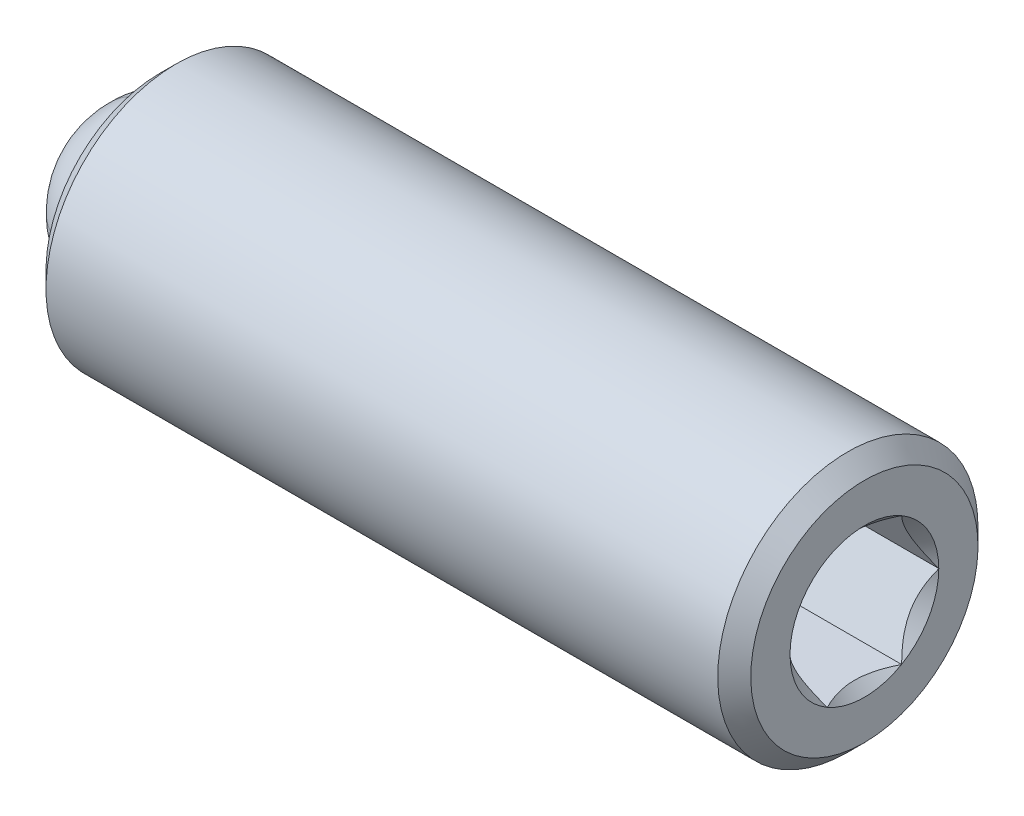
ISO-10303-21;
HEADER;
FILE_DESCRIPTION(('STEP AP214'),'2;1');
FILE_NAME('part.step','',(''),(''),'','','');
FILE_SCHEMA(('AUTOMOTIVE_DESIGN { 1 0 10303 214 1 1 1 1 }'));
ENDSEC;
DATA;
#1=APPLICATION_CONTEXT('core data for automotive mechanical design processes');
#2=APPLICATION_PROTOCOL_DEFINITION('international standard','automotive_design',2000,#1);
#3=PRODUCT_CONTEXT('',#1,'mechanical');
#4=PRODUCT('Part','Part','',(#3));
#5=PRODUCT_RELATED_PRODUCT_CATEGORY('part','',(#4));
#6=PRODUCT_DEFINITION_FORMATION('','',#4);
#7=PRODUCT_DEFINITION_CONTEXT('part definition',#1,'design');
#8=PRODUCT_DEFINITION('design','',#6,#7);
#9=PRODUCT_DEFINITION_SHAPE('','',#8);
#10=(LENGTH_UNIT() NAMED_UNIT(*) SI_UNIT(.MILLI.,.METRE.));
#11=(NAMED_UNIT(*) PLANE_ANGLE_UNIT() SI_UNIT($,.RADIAN.));
#12=(NAMED_UNIT(*) SI_UNIT($,.STERADIAN.) SOLID_ANGLE_UNIT());
#13=UNCERTAINTY_MEASURE_WITH_UNIT(LENGTH_MEASURE(1.E-05),#10,'distance_accuracy_value','');
#14=(GEOMETRIC_REPRESENTATION_CONTEXT(3) GLOBAL_UNCERTAINTY_ASSIGNED_CONTEXT((#13)) GLOBAL_UNIT_ASSIGNED_CONTEXT((#10,
#11,#12)) REPRESENTATION_CONTEXT('',''));
#15=CARTESIAN_POINT('',(0.,0.,0.));
#16=DIRECTION('',(0.,0.,1.));
#17=DIRECTION('',(1.,0.,0.));
#18=AXIS2_PLACEMENT_3D('',#15,#16,#17);
#19=CARTESIAN_POINT('',(0.180392968043054,9.47169867271214,-5.31063574101154));
#20=DIRECTION('',(1.,0.,0.));
#21=DIRECTION('',(0.,0.,-1.));
#22=AXIS2_PLACEMENT_3D('',#19,#20,#21);
#23=PLANE('',#22);
#24=CARTESIAN_POINT('',(0.180392968043055,9.47169867271214,-5.31063574101154));
#25=DIRECTION('',(1.,0.,0.));
#26=DIRECTION('',(0.,0.,-1.));
#27=AXIS2_PLACEMENT_3D('',#24,#25,#26);
#28=CIRCLE('',#27,0.99694999999999);
#29=CARTESIAN_POINT('',(0.180392968043055,10.0642905370944,-6.11234902190932));
#30=VERTEX_POINT('',#29);
#31=CARTESIAN_POINT('',(0.180392968043055,10.4622986727121,-5.4229787091937));
#32=VERTEX_POINT('',#31);
#33=EDGE_CURVE('P0_E11',#30,#32,#28,.T.);
#34=ORIENTED_EDGE('',*,*,#33,.F.);
#35=DIRECTION('',(0.,0.866025403784439,0.5));
#36=VECTOR('',#35,1.);
#37=CARTESIAN_POINT('',(0.180392968043054,9.47169867271214,-6.45448209433002));
#38=LINE('',#37,#36);
#39=CARTESIAN_POINT('',(0.180392968043054,10.4622986727121,-5.88255891767078));
#40=VERTEX_POINT('',#39);
#41=EDGE_CURVE('P0_E247',#30,#40,#38,.T.);
#42=ORIENTED_EDGE('',*,*,#41,.T.);
#43=DIRECTION('',(0.,0.,1.));
#44=VECTOR('',#43,1.);
#45=CARTESIAN_POINT('',(0.180392968043054,10.4622986727121,-5.88255891767078));
#46=LINE('',#45,#44);
#47=EDGE_CURVE('P0_E254',#40,#32,#46,.T.);
#48=ORIENTED_EDGE('',*,*,#47,.T.);
#49=EDGE_LOOP('',(#34,#42,#48));
#50=FACE_BOUND('',#49,.T.);
#51=ADVANCED_FACE('P0_F17',(#50),#23,.T.);
#52=CARTESIAN_POINT('',(0.180392968043055,10.4622986727121,-5.19829277282938));
#53=VERTEX_POINT('',#52);
#54=CARTESIAN_POINT('',(0.180392968043055,10.0642905370944,-4.50892246011375));
#55=VERTEX_POINT('',#54);
#56=EDGE_CURVE('P0_E32',#53,#55,#28,.T.);
#57=ORIENTED_EDGE('',*,*,#56,.F.);
#58=CARTESIAN_POINT('',(0.180392968043054,10.4622986727121,-4.7387125643523));
#59=VERTEX_POINT('',#58);
#60=EDGE_CURVE('P0_E252',#53,#59,#46,.T.);
#61=ORIENTED_EDGE('',*,*,#60,.T.);
#62=DIRECTION('',(0.,-0.866025403784439,0.5));
#63=VECTOR('',#62,1.);
#64=CARTESIAN_POINT('',(0.180392968043054,10.4622986727121,-4.7387125643523));
#65=LINE('',#64,#63);
#66=EDGE_CURVE('P0_E228',#59,#55,#65,.T.);
#67=ORIENTED_EDGE('',*,*,#66,.T.);
#68=EDGE_LOOP('',(#57,#61,#67));
#69=FACE_BOUND('',#68,.T.);
#70=ADVANCED_FACE('P0_F346',(#69),#23,.T.);
#71=CARTESIAN_POINT('',(0.180392968043055,9.86970680832984,-4.39657949193159));
#72=VERTEX_POINT('',#71);
#73=CARTESIAN_POINT('',(0.180392968043055,9.07369053709444,-4.39657949193159));
#74=VERTEX_POINT('',#73);
#75=EDGE_CURVE('P0_E327',#72,#74,#28,.T.);
#76=ORIENTED_EDGE('',*,*,#75,.F.);
#77=CARTESIAN_POINT('',(0.180392968043054,9.47169867271214,-4.16678938769305));
#78=VERTEX_POINT('',#77);
#79=EDGE_CURVE('P0_E233',#72,#78,#65,.T.);
#80=ORIENTED_EDGE('',*,*,#79,.T.);
#81=DIRECTION('',(0.,-0.866025403784439,-0.5));
#82=VECTOR('',#81,1.);
#83=CARTESIAN_POINT('',(0.180392968043054,9.47169867271214,-4.16678938769305));
#84=LINE('',#83,#82);
#85=EDGE_CURVE('P0_E234',#78,#74,#84,.T.);
#86=ORIENTED_EDGE('',*,*,#85,.T.);
#87=EDGE_LOOP('',(#76,#80,#86));
#88=FACE_BOUND('',#87,.T.);
#89=ADVANCED_FACE('P0_F393',(#88),#23,.T.);
#90=CARTESIAN_POINT('',(0.180392968043055,8.87910680832983,-4.50892246011376));
#91=VERTEX_POINT('',#90);
#92=CARTESIAN_POINT('',(0.180392968043055,8.48109867271214,-5.19829277282937));
#93=VERTEX_POINT('',#92);
#94=EDGE_CURVE('P0_E322',#91,#93,#28,.T.);
#95=ORIENTED_EDGE('',*,*,#94,.F.);
#96=CARTESIAN_POINT('',(0.180392968043054,8.48109867271214,-4.73871256435229));
#97=VERTEX_POINT('',#96);
#98=EDGE_CURVE('P0_E231',#91,#97,#84,.T.);
#99=ORIENTED_EDGE('',*,*,#98,.T.);
#100=DIRECTION('',(0.,0.,-1.));
#101=VECTOR('',#100,1.);
#102=CARTESIAN_POINT('',(0.180392968043054,8.48109867271214,-4.73871256435229));
#103=LINE('',#102,#101);
#104=EDGE_CURVE('P0_E239',#97,#93,#103,.T.);
#105=ORIENTED_EDGE('',*,*,#104,.T.);
#106=EDGE_LOOP('',(#95,#99,#105));
#107=FACE_BOUND('',#106,.T.);
#108=ADVANCED_FACE('P0_F404',(#107),#23,.T.);
#109=CARTESIAN_POINT('',(0.180392968043055,8.48109867271214,-5.42297870919371));
#110=VERTEX_POINT('',#109);
#111=CARTESIAN_POINT('',(0.180392968043055,8.87910680832983,-6.11234902190932));
#112=VERTEX_POINT('',#111);
#113=EDGE_CURVE('P0_E319',#110,#112,#28,.T.);
#114=ORIENTED_EDGE('',*,*,#113,.F.);
#115=CARTESIAN_POINT('',(0.180392968043054,8.48109867271214,-5.88255891767078));
#116=VERTEX_POINT('',#115);
#117=EDGE_CURVE('P0_E237',#110,#116,#103,.T.);
#118=ORIENTED_EDGE('',*,*,#117,.T.);
#119=DIRECTION('',(0.,0.866025403784439,-0.5));
#120=VECTOR('',#119,1.);
#121=CARTESIAN_POINT('',(0.180392968043054,8.48109867271214,-5.88255891767078));
#122=LINE('',#121,#120);
#123=EDGE_CURVE('P0_E244',#116,#112,#122,.T.);
#124=ORIENTED_EDGE('',*,*,#123,.T.);
#125=EDGE_LOOP('',(#114,#118,#124));
#126=FACE_BOUND('',#125,.T.);
#127=ADVANCED_FACE('P0_F397',(#126),#23,.T.);
#128=CARTESIAN_POINT('',(-7.60320703195695,10.8686986727121,-5.31063574101154));
#129=DIRECTION('',(1.,0.,0.));
#130=DIRECTION('',(0.,1.,0.));
#131=AXIS2_PLACEMENT_3D('',#128,#129,#130);
#132=PLANE('',#131);
#133=CARTESIAN_POINT('',(-7.60320703195695,9.47169867271214,-5.31063574101154));
#134=DIRECTION('',(1.,0.,0.));
#135=DIRECTION('',(0.,1.,0.));
#136=AXIS2_PLACEMENT_3D('',#133,#134,#135);
#137=CIRCLE('',#136,1.746);
#138=CARTESIAN_POINT('',(-7.60320703195695,11.2176986727121,-5.31063574101154));
#139=VERTEX_POINT('',#138);
#140=EDGE_CURVE('P0_E313',#139,#139,#137,.F.);
#141=ORIENTED_EDGE('',*,*,#140,.T.);
#142=EDGE_LOOP('',(#141));
#143=FACE_BOUND('',#142,.T.);
#144=CARTESIAN_POINT('',(-7.60320703195695,9.47169867271214,-5.31063574101154));
#145=DIRECTION('',(-1.,0.,0.));
#146=DIRECTION('',(0.,-1.,0.));
#147=AXIS2_PLACEMENT_3D('',#144,#145,#146);
#148=CIRCLE('',#147,1.397);
#149=CARTESIAN_POINT('',(-7.60320703195695,8.07469867271214,-5.31063574101154));
#150=VERTEX_POINT('',#149);
#151=EDGE_CURVE('P0_E302',#150,#150,#148,.T.);
#152=ORIENTED_EDGE('',*,*,#151,.F.);
#153=EDGE_LOOP('',(#152));
#154=FACE_BOUND('',#153,.T.);
#155=ADVANCED_FACE('P0_F403',(#143,#154),#132,.F.);
#156=CARTESIAN_POINT('',(-5.41811350547307,9.47169867271214,-5.31063574101154));
#157=DIRECTION('',(-1.,0.,0.));
#158=DIRECTION('',(0.,-1.,0.));
#159=AXIS2_PLACEMENT_3D('',#156,#157,#158);
#160=CYLINDRICAL_SURFACE('',#159,1.397);
#161=CARTESIAN_POINT('',(-6.81511350547307,9.47169867271214,-5.31063574101154));
#162=DIRECTION('',(-1.,0.,0.));
#163=DIRECTION('',(0.,-1.,0.));
#164=AXIS2_PLACEMENT_3D('',#161,#162,#163);
#165=CIRCLE('',#164,1.397);
#166=CARTESIAN_POINT('',(-6.81511350547307,8.07469867271214,-5.31063574101154));
#167=VERTEX_POINT('',#166);
#168=EDGE_CURVE('P0_E285',#167,#167,#165,.T.);
#169=ORIENTED_EDGE('',*,*,#168,.F.);
#170=EDGE_LOOP('',(#169));
#171=FACE_BOUND('',#170,.T.);
#172=ORIENTED_EDGE('',*,*,#151,.T.);
#173=EDGE_LOOP('',(#172));
#174=FACE_BOUND('',#173,.T.);
#175=ADVANCED_FACE('P0_F410',(#171,#174),#160,.F.);
#176=CARTESIAN_POINT('',(-6.81511350547307,9.47169867271214,-5.31063574101154));
#177=DIRECTION('',(-1.,0.,0.));
#178=DIRECTION('',(0.,-1.,0.));
#179=AXIS2_PLACEMENT_3D('',#176,#177,#178);
#180=CONICAL_SURFACE('',#179,1.397,0.78539816339745);
#181=CARTESIAN_POINT('',(-5.41811350547307,9.47169867271214,-5.31063574101154));
#182=VERTEX_POINT('',#181);
#183=VERTEX_LOOP('',#182);
#184=FACE_BOUND('',#183,.T.);
#185=ORIENTED_EDGE('',*,*,#168,.T.);
#186=EDGE_LOOP('',(#185));
#187=FACE_BOUND('',#186,.T.);
#188=ADVANCED_FACE('P0_F601',(#184,#187),#180,.F.);
#189=CARTESIAN_POINT('',(3.22839296804305,9.47169867271214,-5.31063574101154));
#190=DIRECTION('',(-1.,0.,0.));
#191=DIRECTION('',(0.,-1.,0.));
#192=AXIS2_PLACEMENT_3D('',#189,#190,#191);
#193=PLANE('',#192);
#194=DIRECTION('',(0.,-0.866025403784439,-0.5));
#195=VECTOR('',#194,1.);
#196=CARTESIAN_POINT('',(3.22839296804305,9.47169867271214,-4.16678938769305));
#197=LINE('',#196,#195);
#198=CARTESIAN_POINT('',(3.22839296804305,8.48256623149346,-4.73786526889485));
#199=VERTEX_POINT('',#198);
#200=CARTESIAN_POINT('',(3.22839296804305,8.48109867271214,-4.73871256435229));
#201=VERTEX_POINT('',#200);
#202=EDGE_CURVE('P0_E262',#199,#201,#197,.T.);
#203=ORIENTED_EDGE('',*,*,#202,.F.);
#204=CARTESIAN_POINT('',(3.22839296804305,9.47169867271214,-5.31063574101154));
#205=DIRECTION('',(1.,0.,0.));
#206=DIRECTION('',(0.,1.,0.));
#207=AXIS2_PLACEMENT_3D('',#204,#205,#206);
#208=CIRCLE('',#207,1.143);
#209=CARTESIAN_POINT('',(3.22839296804305,9.47023111393082,-4.1676366831505));
#210=VERTEX_POINT('',#209);
#211=EDGE_CURVE('P0_E359',#210,#199,#208,.T.);
#212=ORIENTED_EDGE('',*,*,#211,.F.);
#213=CARTESIAN_POINT('',(3.22839296804305,9.47169867271214,-4.16678938769305));
#214=VERTEX_POINT('',#213);
#215=EDGE_CURVE('P0_E263',#214,#210,#197,.T.);
#216=ORIENTED_EDGE('',*,*,#215,.F.);
#217=DIRECTION('',(0.,-0.866025403784439,0.5));
#218=VECTOR('',#217,1.);
#219=CARTESIAN_POINT('',(3.22839296804305,10.4622986727121,-4.7387125643523));
#220=LINE('',#219,#218);
#221=CARTESIAN_POINT('',(3.22839296804305,9.47316459966091,-4.16763574101154));
#222=VERTEX_POINT('',#221);
#223=EDGE_CURVE('P0_E221',#222,#214,#220,.T.);
#224=ORIENTED_EDGE('',*,*,#223,.F.);
#225=CARTESIAN_POINT('',(3.22839296804305,10.4608311139308,-4.73786526889485));
#226=VERTEX_POINT('',#225);
#227=EDGE_CURVE('P0_E48',#226,#222,#208,.T.);
#228=ORIENTED_EDGE('',*,*,#227,.F.);
#229=CARTESIAN_POINT('',(3.22839296804305,10.4622986727121,-4.7387125643523));
#230=VERTEX_POINT('',#229);
#231=EDGE_CURVE('P0_E259',#230,#226,#220,.T.);
#232=ORIENTED_EDGE('',*,*,#231,.F.);
#233=DIRECTION('',(0.,0.,1.));
#234=VECTOR('',#233,1.);
#235=CARTESIAN_POINT('',(3.22839296804305,10.4622986727121,-5.88255891767078));
#236=LINE('',#235,#234);
#237=CARTESIAN_POINT('',(3.22839296804305,10.4622986727121,-4.74040715526719));
#238=VERTEX_POINT('',#237);
#239=EDGE_CURVE('P0_E278',#238,#230,#236,.T.);
#240=ORIENTED_EDGE('',*,*,#239,.F.);
#241=CARTESIAN_POINT('',(3.22839296804305,10.4622986727121,-5.88086432675589));
#242=VERTEX_POINT('',#241);
#243=EDGE_CURVE('P0_E165',#242,#238,#208,.T.);
#244=ORIENTED_EDGE('',*,*,#243,.F.);
#245=CARTESIAN_POINT('',(3.22839296804305,10.4622986727121,-5.88255891767078));
#246=VERTEX_POINT('',#245);
#247=EDGE_CURVE('P0_E279',#246,#242,#236,.T.);
#248=ORIENTED_EDGE('',*,*,#247,.F.);
#249=DIRECTION('',(0.,0.866025403784439,0.5));
#250=VECTOR('',#249,1.);
#251=CARTESIAN_POINT('',(3.22839296804305,9.47169867271214,-6.45448209433002));
#252=LINE('',#251,#250);
#253=CARTESIAN_POINT('',(3.22839296804305,10.4608311139308,-5.88340621312823));
#254=VERTEX_POINT('',#253);
#255=EDGE_CURVE('P0_E274',#254,#246,#252,.T.);
#256=ORIENTED_EDGE('',*,*,#255,.F.);
#257=CARTESIAN_POINT('',(3.22839296804305,9.47316623149346,-6.45363479887258));
#258=VERTEX_POINT('',#257);
#259=EDGE_CURVE('P0_E168',#258,#254,#208,.T.);
#260=ORIENTED_EDGE('',*,*,#259,.F.);
#261=CARTESIAN_POINT('',(3.22839296804305,9.47169867271214,-6.45448209433002));
#262=VERTEX_POINT('',#261);
#263=EDGE_CURVE('P0_E275',#262,#258,#252,.T.);
#264=ORIENTED_EDGE('',*,*,#263,.F.);
#265=DIRECTION('',(0.,0.866025403784439,-0.5));
#266=VECTOR('',#265,1.);
#267=CARTESIAN_POINT('',(3.22839296804305,8.48109867271214,-5.88255891767078));
#268=LINE('',#267,#266);
#269=CARTESIAN_POINT('',(3.22839296804305,9.47023274576337,-6.45363574101154));
#270=VERTEX_POINT('',#269);
#271=EDGE_CURVE('P0_E270',#270,#262,#268,.T.);
#272=ORIENTED_EDGE('',*,*,#271,.F.);
#273=CARTESIAN_POINT('',(3.22839296804305,8.48256623149346,-5.88340621312823));
#274=VERTEX_POINT('',#273);
#275=EDGE_CURVE('P0_E363',#274,#270,#208,.T.);
#276=ORIENTED_EDGE('',*,*,#275,.F.);
#277=CARTESIAN_POINT('',(3.22839296804305,8.48109867271214,-5.88255891767078));
#278=VERTEX_POINT('',#277);
#279=EDGE_CURVE('P0_E271',#278,#274,#268,.T.);
#280=ORIENTED_EDGE('',*,*,#279,.F.);
#281=DIRECTION('',(0.,0.,-1.));
#282=VECTOR('',#281,1.);
#283=CARTESIAN_POINT('',(3.22839296804305,8.48109867271214,-4.73871256435229));
#284=LINE('',#283,#282);
#285=CARTESIAN_POINT('',(3.22839296804305,8.48109867271214,-5.88086432675589));
#286=VERTEX_POINT('',#285);
#287=EDGE_CURVE('P0_E266',#286,#278,#284,.T.);
#288=ORIENTED_EDGE('',*,*,#287,.F.);
#289=CARTESIAN_POINT('',(3.22839296804305,8.48109867271214,-4.74040715526719));
#290=VERTEX_POINT('',#289);
#291=EDGE_CURVE('P0_E360',#290,#286,#208,.T.);
#292=ORIENTED_EDGE('',*,*,#291,.F.);
#293=EDGE_CURVE('P0_E267',#201,#290,#284,.T.);
#294=ORIENTED_EDGE('',*,*,#293,.F.);
#295=EDGE_LOOP('',(#203,#212,#216,#224,#228,#232,#240,#244,#248,#256,#260,#264,#272,#276,#280,
#288,#292,#294));
#296=FACE_BOUND('',#295,.T.);
#297=CARTESIAN_POINT('',(3.22839296804305,9.47169867271214,-5.31063574101154));
#298=DIRECTION('',(-1.,0.,0.));
#299=DIRECTION('',(0.,-1.,0.));
#300=AXIS2_PLACEMENT_3D('',#297,#298,#299);
#301=CIRCLE('',#300,1.746);
#302=CARTESIAN_POINT('',(3.22839296804305,7.72569867271214,-5.31063574101154));
#303=VERTEX_POINT('',#302);
#304=EDGE_CURVE('P0_E311',#303,#303,#301,.F.);
#305=ORIENTED_EDGE('',*,*,#304,.T.);
#306=EDGE_LOOP('',(#305));
#307=FACE_BOUND('',#306,.T.);
#308=ADVANCED_FACE('P0_F354',(#296,#307),#193,.F.);
#309=CARTESIAN_POINT('',(-5.41811350547307,9.47169867271214,-5.31063574101154));
#310=DIRECTION('',(-1.,0.,0.));
#311=DIRECTION('',(0.,-1.,0.));
#312=AXIS2_PLACEMENT_3D('',#309,#310,#311);
#313=CYLINDRICAL_SURFACE('',#312,2.);
#314=CARTESIAN_POINT('',(2.97439296804305,9.47169867271214,-5.31063574101154));
#315=DIRECTION('',(-1.,0.,0.));
#316=DIRECTION('',(0.,-1.,0.));
#317=AXIS2_PLACEMENT_3D('',#314,#315,#316);
#318=CIRCLE('',#317,2.);
#319=CARTESIAN_POINT('',(2.97439296804305,7.47169867271214,-5.31063574101154));
#320=VERTEX_POINT('',#319);
#321=EDGE_CURVE('P0_E308',#320,#320,#318,.T.);
#322=ORIENTED_EDGE('',*,*,#321,.T.);
#323=EDGE_LOOP('',(#322));
#324=FACE_BOUND('',#323,.T.);
#325=CARTESIAN_POINT('',(-7.34920703195695,9.47169867271214,-5.31063574101154));
#326=DIRECTION('',(1.,0.,0.));
#327=DIRECTION('',(0.,1.,0.));
#328=AXIS2_PLACEMENT_3D('',#325,#326,#327);
#329=CIRCLE('',#328,2.);
#330=CARTESIAN_POINT('',(-7.34920703195695,11.4716986727121,-5.31063574101154));
#331=VERTEX_POINT('',#330);
#332=EDGE_CURVE('P0_E305',#331,#331,#329,.T.);
#333=ORIENTED_EDGE('',*,*,#332,.T.);
#334=EDGE_LOOP('',(#333));
#335=FACE_BOUND('',#334,.T.);
#336=ADVANCED_FACE('P0_F211',(#324,#335),#313,.T.);
#337=CARTESIAN_POINT('',(2.97439296804305,9.47169867271214,-5.31063574101154));
#338=DIRECTION('',(-1.,0.,0.));
#339=DIRECTION('',(0.,-1.,0.));
#340=AXIS2_PLACEMENT_3D('',#337,#338,#339);
#341=CONICAL_SURFACE('',#340,2.,0.78539816339745);
#342=ORIENTED_EDGE('',*,*,#304,.F.);
#343=EDGE_LOOP('',(#342));
#344=FACE_BOUND('',#343,.T.);
#345=ORIENTED_EDGE('',*,*,#321,.F.);
#346=EDGE_LOOP('',(#345));
#347=FACE_BOUND('',#346,.T.);
#348=ADVANCED_FACE('P0_F574',(#344,#347),#341,.T.);
#349=CARTESIAN_POINT('',(-7.60320703195695,9.47169867271214,-5.31063574101154));
#350=DIRECTION('',(1.,0.,0.));
#351=DIRECTION('',(0.,1.,0.));
#352=AXIS2_PLACEMENT_3D('',#349,#350,#351);
#353=CONICAL_SURFACE('',#352,1.746,0.785398163397447);
#354=ORIENTED_EDGE('',*,*,#332,.F.);
#355=EDGE_LOOP('',(#354));
#356=FACE_BOUND('',#355,.T.);
#357=ORIENTED_EDGE('',*,*,#140,.F.);
#358=EDGE_LOOP('',(#357));
#359=FACE_BOUND('',#358,.T.);
#360=ADVANCED_FACE('P0_F19',(#356,#359),#353,.T.);
#361=CARTESIAN_POINT('',(0.180392968043054,10.4622986727121,-4.7387125643523));
#362=DIRECTION('',(0.,0.5,0.866025403784439));
#363=DIRECTION('',(0.,-0.866025403784439,0.5));
#364=AXIS2_PLACEMENT_3D('',#361,#362,#363);
#365=PLANE('',#364);
#366=ORIENTED_EDGE('',*,*,#231,.T.);
#367=CARTESIAN_POINT('',(3.22859296804327,10.4611782048666,-4.73806566194003));
#368=CARTESIAN_POINT('',(3.20902650942257,10.4271981526644,-4.71844726965406));
#369=CARTESIAN_POINT('',(3.19061235414986,10.39265070629,-4.69850129218998));
#370=CARTESIAN_POINT('',(3.15690224896556,10.3222088641086,-4.65783167564432));
#371=CARTESIAN_POINT('',(3.14162495574689,10.2863078319104,-4.63710420504048));
#372=CARTESIAN_POINT('',(3.11545811453832,10.2139157570677,-4.5953086211429));
#373=CARTESIAN_POINT('',(3.10450308443333,10.1774429854838,-4.57425105665082));
#374=CARTESIAN_POINT('',(3.08762700747996,10.103698565716,-4.53167469604664));
#375=CARTESIAN_POINT('',(3.08169344522599,10.0664291424649,-4.51015718450008));
#376=CARTESIAN_POINT('',(3.07633957948692,10.0021344350583,-4.47303661787141));
#377=CARTESIAN_POINT('',(3.07555215934539,9.97519176257048,-4.45748125865788));
#378=CARTESIAN_POINT('',(3.07690556505428,9.92135924288741,-4.42640103892771));
#379=CARTESIAN_POINT('',(3.0790470423144,9.89446940877598,-4.41087618596501));
#380=CARTESIAN_POINT('',(3.08972297627782,9.81418524622342,-4.36452410310362));
#381=CARTESIAN_POINT('',(3.10251008931636,9.76119119302302,-4.33392797222292));
#382=CARTESIAN_POINT('',(3.13327126073398,9.66844209710657,-4.28037925672847));
#383=CARTESIAN_POINT('',(3.14959520035295,9.62824129683496,-4.25716931387001));
#384=CARTESIAN_POINT('',(3.18634845720896,9.54940556558132,-4.21165348320896));
#385=CARTESIAN_POINT('',(3.20676437484175,9.51076600589305,-4.18934492302157));
#386=CARTESIAN_POINT('',(3.22859296804305,9.47281914055808,-4.16743629010553));
#387=B_SPLINE_CURVE_WITH_KNOTS('',3,(#367,#368,#369,#370,#371,#372,#373,#374,#375,#376,#377,
#378,#379,#380,#381,#382,#383,#384,#385,#386),.UNSPECIFIED.,.F.,.F.,(4,2,2,2,2,2,2,2,2,4),(0.,
0.131625127619602,0.264011770716204,0.394307736662358,0.524277991049733,0.61750464694129,
0.71075204054236,0.897297861024574,1.04472299547961,1.19167303462289),.UNSPECIFIED.);
#388=EDGE_CURVE('P0_E214',#226,#222,#387,.T.);
#389=ORIENTED_EDGE('',*,*,#388,.T.);
#390=ORIENTED_EDGE('',*,*,#223,.T.);
#391=DIRECTION('',(1.,0.,0.));
#392=VECTOR('',#391,1.);
#393=CARTESIAN_POINT('',(0.180392968043054,9.47169867271214,-4.16678938769305));
#394=LINE('',#393,#392);
#395=EDGE_CURVE('P0_E257',#78,#214,#394,.T.);
#396=ORIENTED_EDGE('',*,*,#395,.F.);
#397=ORIENTED_EDGE('',*,*,#79,.F.);
#398=EDGE_CURVE('P0_E232',#55,#72,#65,.T.);
#399=ORIENTED_EDGE('',*,*,#398,.F.);
#400=ORIENTED_EDGE('',*,*,#66,.F.);
#401=DIRECTION('',(1.,0.,0.));
#402=VECTOR('',#401,1.);
#403=CARTESIAN_POINT('',(0.180392968043054,10.4622986727121,-4.7387125643523));
#404=LINE('',#403,#402);
#405=EDGE_CURVE('P0_E282',#59,#230,#404,.T.);
#406=ORIENTED_EDGE('',*,*,#405,.T.);
#407=EDGE_LOOP('',(#366,#389,#390,#396,#397,#399,#400,#406));
#408=FACE_BOUND('',#407,.T.);
#409=ADVANCED_FACE('P0_F205',(#408),#365,.F.);
#410=CARTESIAN_POINT('',(0.180392968043054,10.4622986727121,-5.88255891767078));
#411=DIRECTION('',(0.,1.,0.));
#412=DIRECTION('',(0.,0.,1.));
#413=AXIS2_PLACEMENT_3D('',#410,#411,#412);
#414=PLANE('',#413);
#415=ORIENTED_EDGE('',*,*,#247,.T.);
#416=CARTESIAN_POINT('',(3.59570318481879,10.4622986727121,-6.45070091059492));
#417=CARTESIAN_POINT('',(3.57474972575544,10.4622986727121,-6.42293842392982));
#418=CARTESIAN_POINT('',(3.55400188885525,10.4622986727121,-6.39502118209199));
#419=CARTESIAN_POINT('',(3.5130023791237,10.4622986727121,-6.33881442617575));
#420=CARTESIAN_POINT('',(3.49275083134308,10.4622986727121,-6.31052482097715));
#421=CARTESIAN_POINT('',(3.4325790283938,10.4622986727121,-6.2245891246577));
#422=CARTESIAN_POINT('',(3.39356434305211,10.4622986727121,-6.16629826503015));
#423=CARTESIAN_POINT('',(3.31697919410661,10.4622986727121,-6.04406836242025));
#424=CARTESIAN_POINT('',(3.27961787130016,10.4622986727121,-5.97999677039252));
#425=CARTESIAN_POINT('',(3.21127977420377,10.4622986727121,-5.84865409060757));
#426=CARTESIAN_POINT('',(3.1802814773501,10.4622986727121,-5.78139476840388));
#427=CARTESIAN_POINT('',(3.14235811095437,10.4622986727121,-5.68043234276318));
#428=CARTESIAN_POINT('',(3.13147285764775,10.4622986727121,-5.64822276177993));
#429=CARTESIAN_POINT('',(3.1122883171656,10.4622986727121,-5.58302650769072));
#430=CARTESIAN_POINT('',(3.10398920830285,10.4622986727121,-5.55003978116972));
#431=CARTESIAN_POINT('',(3.09054716193858,10.4622986727121,-5.48404253052561));
#432=CARTESIAN_POINT('',(3.08534972830344,10.4622986727121,-5.45104328161498));
#433=CARTESIAN_POINT('',(3.07820909094747,10.4622986727121,-5.38468174697183));
#434=CARTESIAN_POINT('',(3.07626638486291,10.4622986727121,-5.35131940650863));
#435=CARTESIAN_POINT('',(3.07578238551576,10.4622986727121,-5.28577621049882));
#436=CARTESIAN_POINT('',(3.07712077837641,10.4622986727121,-5.25359620205024));
#437=CARTESIAN_POINT('',(3.08285889832064,10.4622986727121,-5.18952282412405));
#438=CARTESIAN_POINT('',(3.08725792197463,10.4622986727121,-5.15762939048823));
#439=CARTESIAN_POINT('',(3.098951846285,10.4622986727121,-5.09380411923337));
#440=CARTESIAN_POINT('',(3.10629646335219,10.4622986727121,-5.06188152922137));
#441=CARTESIAN_POINT('',(3.12349136437113,10.4622986727121,-4.99873377437021));
#442=CARTESIAN_POINT('',(3.1333414379426,10.4622986727121,-4.96750855121329));
#443=CARTESIAN_POINT('',(3.16806646410627,10.4622986727121,-4.86917271271039));
#444=CARTESIAN_POINT('',(3.19689729777147,10.4622986727121,-4.80346243249055));
#445=CARTESIAN_POINT('',(3.26099837633354,10.4622986727121,-4.67512903723325));
#446=CARTESIAN_POINT('',(3.29629176147741,10.4622986727121,-4.61251807751064));
#447=CARTESIAN_POINT('',(3.36910429394989,10.4622986727121,-4.49285991026648));
#448=CARTESIAN_POINT('',(3.40642565041756,10.4622986727121,-4.43569083811957));
#449=CARTESIAN_POINT('',(3.46412025413777,10.4622986727121,-4.35146370273486));
#450=CARTESIAN_POINT('',(3.4835551496593,10.4622986727121,-4.32375151954404));
#451=CARTESIAN_POINT('',(3.5229388622672,10.4622986727121,-4.26870581303537));
#452=CARTESIAN_POINT('',(3.5428875373647,10.4622986727121,-4.24137218824255));
#453=CARTESIAN_POINT('',(3.56304924099892,10.4622986727121,-4.21419618453529));
#454=B_SPLINE_CURVE_WITH_KNOTS('',3,(#416,#417,#418,#419,#420,#421,#422,#423,#424,#425,#426,
#427,#428,#429,#430,#431,#432,#433,#434,#435,#436,#437,#438,#439,#440,#441,#442,#443,#444,#445,
#446,#447,#448,#449,#450,#451,#452,#453),.UNSPECIFIED.,.F.,.F.,(4,2,2,2,2,2,2,2,2,2,2,2,2,2,2,2,
2,2,4),(0.,0.104344019556666,0.208714065995309,0.41904723860194,0.64137159542651,
0.862931089855695,0.964842435960927,1.06676080722523,1.16683130424735,1.26691710029625,
1.36338812254199,1.45983698002154,1.55798726512869,1.65612931138883,1.87076833826788,
2.08619150382141,2.29090841446405,2.39244822901591,2.49396027677513),.UNSPECIFIED.);
#455=EDGE_CURVE('P0_E222',#242,#238,#454,.T.);
#456=ORIENTED_EDGE('',*,*,#455,.T.);
#457=ORIENTED_EDGE('',*,*,#239,.T.);
#458=ORIENTED_EDGE('',*,*,#405,.F.);
#459=ORIENTED_EDGE('',*,*,#60,.F.);
#460=EDGE_CURVE('P0_E258',#32,#53,#46,.T.);
#461=ORIENTED_EDGE('',*,*,#460,.F.);
#462=ORIENTED_EDGE('',*,*,#47,.F.);
#463=DIRECTION('',(1.,0.,0.));
#464=VECTOR('',#463,1.);
#465=CARTESIAN_POINT('',(0.180392968043054,10.4622986727121,-5.88255891767078));
#466=LINE('',#465,#464);
#467=EDGE_CURVE('P0_E286',#40,#246,#466,.T.);
#468=ORIENTED_EDGE('',*,*,#467,.T.);
#469=EDGE_LOOP('',(#415,#456,#457,#458,#459,#461,#462,#468));
#470=FACE_BOUND('',#469,.T.);
#471=ADVANCED_FACE('P0_F209',(#470),#414,.F.);
#472=CARTESIAN_POINT('',(0.180392968043054,9.47169867271214,-6.45448209433002));
#473=DIRECTION('',(0.,0.5,-0.866025403784439));
#474=DIRECTION('',(0.,0.866025403784439,0.5));
#475=AXIS2_PLACEMENT_3D('',#472,#473,#474);
#476=PLANE('',#475);
#477=ORIENTED_EDGE('',*,*,#263,.T.);
#478=CARTESIAN_POINT('',(3.22859296804305,9.47281914055808,-6.45383519191755));
#479=CARTESIAN_POINT('',(3.20902650942238,9.50679919276017,-6.43421679963159));
#480=CARTESIAN_POINT('',(3.19061235414969,9.54134663913457,-6.41427082216752));
#481=CARTESIAN_POINT('',(3.15690224896544,9.61178848131595,-6.37360120562189));
#482=CARTESIAN_POINT('',(3.14162495574679,9.64768951351416,-6.35287373501807));
#483=CARTESIAN_POINT('',(3.11545811453826,9.72008158835673,-6.31107815112052));
#484=CARTESIAN_POINT('',(3.10450308443328,9.75655435994065,-6.29002058662845));
#485=CARTESIAN_POINT('',(3.08762700747993,9.83029877970841,-6.2474442260243));
#486=CARTESIAN_POINT('',(3.08169344522598,9.86756820295947,-6.22592671447775));
#487=CARTESIAN_POINT('',(3.07633957948691,9.93186291036605,-6.1888061478491));
#488=CARTESIAN_POINT('',(3.07555215934539,9.95880558285385,-6.17325078863558));
#489=CARTESIAN_POINT('',(3.07690556505429,10.0126381025369,-6.1421705689054));
#490=CARTESIAN_POINT('',(3.0790470423144,10.0395279366484,-6.1266457159427));
#491=CARTESIAN_POINT('',(3.08972297627783,10.1198120992009,-6.08029363308132));
#492=CARTESIAN_POINT('',(3.10251008931638,10.1728061524013,-6.04969750220062));
#493=CARTESIAN_POINT('',(3.13327126073402,10.2655552483178,-5.99614878670614));
#494=CARTESIAN_POINT('',(3.14959520035302,10.3057560485895,-5.97293884384765));
#495=CARTESIAN_POINT('',(3.1863484572091,10.3845917798432,-5.92742301318654));
#496=CARTESIAN_POINT('',(3.20676437484192,10.4232313395315,-5.90511445299912));
#497=CARTESIAN_POINT('',(3.22859296804327,10.4611782048666,-5.88320582008304));
#498=B_SPLINE_CURVE_WITH_KNOTS('',3,(#478,#479,#480,#481,#482,#483,#484,#485,#486,#487,#488,
#489,#490,#491,#492,#493,#494,#495,#496,#497),.UNSPECIFIED.,.F.,.F.,(4,2,2,2,2,2,2,2,2,4),(0.,
0.131625127619502,0.264011770716005,0.39430773666206,0.524277991049337,0.617504646940888,
0.710752040541954,0.897297861024162,1.04472299547941,1.19167303462289),.UNSPECIFIED.);
#499=EDGE_CURVE('P0_E373',#258,#254,#498,.T.);
#500=ORIENTED_EDGE('',*,*,#499,.T.);
#501=ORIENTED_EDGE('',*,*,#255,.T.);
#502=ORIENTED_EDGE('',*,*,#467,.F.);
#503=ORIENTED_EDGE('',*,*,#41,.F.);
#504=CARTESIAN_POINT('',(0.180392968043055,9.86970680832983,-6.22469199009149));
#505=VERTEX_POINT('',#504);
#506=EDGE_CURVE('P0_E253',#505,#30,#38,.T.);
#507=ORIENTED_EDGE('',*,*,#506,.F.);
#508=CARTESIAN_POINT('',(0.180392968043054,9.47169867271214,-6.45448209433002));
#509=VERTEX_POINT('',#508);
#510=EDGE_CURVE('P0_E249',#509,#505,#38,.T.);
#511=ORIENTED_EDGE('',*,*,#510,.F.);
#512=DIRECTION('',(1.,0.,0.));
#513=VECTOR('',#512,1.);
#514=CARTESIAN_POINT('',(0.180392968043054,9.47169867271214,-6.45448209433002));
#515=LINE('',#514,#513);
#516=EDGE_CURVE('P0_E289',#509,#262,#515,.T.);
#517=ORIENTED_EDGE('',*,*,#516,.T.);
#518=EDGE_LOOP('',(#477,#500,#501,#502,#503,#507,#511,#517));
#519=FACE_BOUND('',#518,.T.);
#520=ADVANCED_FACE('P0_F377',(#519),#476,.F.);
#521=CARTESIAN_POINT('',(0.180392968043054,8.48109867271214,-5.88255891767078));
#522=DIRECTION('',(0.,-0.5,-0.866025403784439));
#523=DIRECTION('',(0.,0.866025403784439,-0.5));
#524=AXIS2_PLACEMENT_3D('',#521,#522,#523);
#525=PLANE('',#524);
#526=ORIENTED_EDGE('',*,*,#279,.T.);
#527=CARTESIAN_POINT('',(3.22859296804327,8.48221914055771,-5.88320582008304));
#528=CARTESIAN_POINT('',(3.20902650942257,8.51619919275983,-5.90282421236901));
#529=CARTESIAN_POINT('',(3.19061235414986,8.55074663913425,-5.9227701898331));
#530=CARTESIAN_POINT('',(3.15690224896556,8.62118848131567,-5.96343980637875));
#531=CARTESIAN_POINT('',(3.14162495574689,8.65708951351391,-5.98416727698259));
#532=CARTESIAN_POINT('',(3.11545811453832,8.72948158835652,-6.02596286088017));
#533=CARTESIAN_POINT('',(3.10450308443333,8.76595435994047,-6.04702042537226));
#534=CARTESIAN_POINT('',(3.08762700747995,8.83969877970829,-6.08959678597644));
#535=CARTESIAN_POINT('',(3.08169344522599,8.87696820295938,-6.111114297523));
#536=CARTESIAN_POINT('',(3.07633957948692,8.94126291036599,-6.14823486415167));
#537=CARTESIAN_POINT('',(3.07555215934539,8.96820558285379,-6.16379022336519));
#538=CARTESIAN_POINT('',(3.07690556505428,9.02203810253686,-6.19487044309537));
#539=CARTESIAN_POINT('',(3.0790470423144,9.0489279366483,-6.21039529605807));
#540=CARTESIAN_POINT('',(3.08972297627782,9.12921209920085,-6.25674737891945));
#541=CARTESIAN_POINT('',(3.10251008931636,9.18220615240125,-6.28734350980015));
#542=CARTESIAN_POINT('',(3.13327126073398,9.2749552483177,-6.34089222529461));
#543=CARTESIAN_POINT('',(3.14959520035295,9.31515604858932,-6.36410216815306));
#544=CARTESIAN_POINT('',(3.18634845720896,9.39399177984296,-6.40961799881411));
#545=CARTESIAN_POINT('',(3.20676437484174,9.43263133953122,-6.4319265590015));
#546=CARTESIAN_POINT('',(3.22859296804305,9.47057820486619,-6.45383519191755));
#547=B_SPLINE_CURVE_WITH_KNOTS('',3,(#527,#528,#529,#530,#531,#532,#533,#534,#535,#536,#537,
#538,#539,#540,#541,#542,#543,#544,#545,#546),.UNSPECIFIED.,.F.,.F.,(4,2,2,2,2,2,2,2,2,4),(0.,
0.1316251276196,0.264011770716204,0.394307736662359,0.524277991049733,0.617504646941288,
0.71075204054236,0.897297861024572,1.04472299547962,1.19167303462289),.UNSPECIFIED.);
#548=EDGE_CURVE('P0_E181',#274,#270,#547,.T.);
#549=ORIENTED_EDGE('',*,*,#548,.T.);
#550=ORIENTED_EDGE('',*,*,#271,.T.);
#551=ORIENTED_EDGE('',*,*,#516,.F.);
#552=CARTESIAN_POINT('',(0.180392968043055,9.07369053709444,-6.22469199009149));
#553=VERTEX_POINT('',#552);
#554=EDGE_CURVE('P0_E242',#553,#509,#122,.T.);
#555=ORIENTED_EDGE('',*,*,#554,.F.);
#556=EDGE_CURVE('P0_E248',#112,#553,#122,.T.);
#557=ORIENTED_EDGE('',*,*,#556,.F.);
#558=ORIENTED_EDGE('',*,*,#123,.F.);
#559=DIRECTION('',(1.,0.,0.));
#560=VECTOR('',#559,1.);
#561=CARTESIAN_POINT('',(0.180392968043054,8.48109867271214,-5.88255891767078));
#562=LINE('',#561,#560);
#563=EDGE_CURVE('P0_E292',#116,#278,#562,.T.);
#564=ORIENTED_EDGE('',*,*,#563,.T.);
#565=EDGE_LOOP('',(#526,#549,#550,#551,#555,#557,#558,#564));
#566=FACE_BOUND('',#565,.T.);
#567=ADVANCED_FACE('P0_F196',(#566),#525,.F.);
#568=CARTESIAN_POINT('',(0.180392968043054,8.48109867271214,-4.73871256435229));
#569=DIRECTION('',(0.,-1.,0.));
#570=DIRECTION('',(0.,0.,-1.));
#571=AXIS2_PLACEMENT_3D('',#568,#569,#570);
#572=PLANE('',#571);
#573=ORIENTED_EDGE('',*,*,#293,.T.);
#574=CARTESIAN_POINT('',(3.5957031849486,8.48109867271214,-6.45070091076688));
#575=CARTESIAN_POINT('',(3.57474972588025,8.48109867271214,-6.42293842409696));
#576=CARTESIAN_POINT('',(3.55400188897507,8.48109867271214,-6.39502118225429));
#577=CARTESIAN_POINT('',(3.51300237923356,8.48109867271214,-6.33881442632833));
#578=CARTESIAN_POINT('',(3.49275083144798,8.48109867271214,-6.31052482112484));
#579=CARTESIAN_POINT('',(3.43257902848372,8.48109867271214,-6.22458912479043));
#580=CARTESIAN_POINT('',(3.39356434313208,8.48109867271214,-6.16629826515271));
#581=CARTESIAN_POINT('',(3.31697919416612,8.48109867271214,-6.04406836252062));
#582=CARTESIAN_POINT('',(3.27961787134924,8.48109867271214,-5.97999677048082));
#583=CARTESIAN_POINT('',(3.2112797742335,8.48109867271214,-5.8486540906707));
#584=CARTESIAN_POINT('',(3.18028147737091,8.48109867271214,-5.78139476845393));
#585=CARTESIAN_POINT('',(3.14235811096854,8.48109867271214,-5.68043234280337));
#586=CARTESIAN_POINT('',(3.13147285766218,8.48109867271214,-5.64822276182425));
#587=CARTESIAN_POINT('',(3.11228831717971,8.48109867271214,-5.58302650774342));
#588=CARTESIAN_POINT('',(3.10398920831638,8.48109867271214,-5.55003978122668));
#589=CARTESIAN_POINT('',(3.09054716194998,8.48109867271214,-5.48404253059095));
#590=CARTESIAN_POINT('',(3.08534972831333,8.48109867271214,-5.45104328168442));
#591=CARTESIAN_POINT('',(3.0782090909534,8.48109867271214,-5.38468174704937));
#592=CARTESIAN_POINT('',(3.07626638486638,8.48109867271214,-5.35131940659015));
#593=CARTESIAN_POINT('',(3.07578238551365,8.48109867271214,-5.28577621058768));
#594=CARTESIAN_POINT('',(3.0771207783712,8.48109867271214,-5.25359620214247));
#595=CARTESIAN_POINT('',(3.08285889830876,8.48109867271214,-5.18952282422271));
#596=CARTESIAN_POINT('',(3.08725792195916,8.48109867271214,-5.15762939058993));
#597=CARTESIAN_POINT('',(3.09895184626204,8.48109867271214,-5.09380411934106));
#598=CARTESIAN_POINT('',(3.10629646332528,8.48109867271214,-5.06188152933202));
#599=CARTESIAN_POINT('',(3.12349136433625,8.48109867271214,-4.99873377448647));
#600=CARTESIAN_POINT('',(3.13334143790368,8.48109867271214,-4.96750855133223));
#601=CARTESIAN_POINT('',(3.16806646404834,8.48109867271214,-4.86917271285523));
#602=CARTESIAN_POINT('',(3.19689729769605,8.48109867271214,-4.80346243265733));
#603=CARTESIAN_POINT('',(3.26099837622122,8.48109867271214,-4.67512903744223));
#604=CARTESIAN_POINT('',(3.29629176134566,8.48109867271214,-4.61251807773986));
#605=CARTESIAN_POINT('',(3.36910429378095,8.48109867271214,-4.49285991053211));
#606=CARTESIAN_POINT('',(3.40642565023102,8.48109867271214,-4.43569083840148));
#607=CARTESIAN_POINT('',(3.46412025392494,8.48109867271214,-4.35146370304084));
#608=CARTESIAN_POINT('',(3.48355514943778,8.48109867271214,-4.32375151985793));
#609=CARTESIAN_POINT('',(3.52293886202829,8.48109867271214,-4.26870581336504));
#610=CARTESIAN_POINT('',(3.5428875371171,8.48109867271214,-4.24137218858007));
#611=CARTESIAN_POINT('',(3.56304924074265,8.48109867271214,-4.21419618488066));
#612=B_SPLINE_CURVE_WITH_KNOTS('',3,(#574,#575,#576,#577,#578,#579,#580,#581,#582,#583,#584,
#585,#586,#587,#588,#589,#590,#591,#592,#593,#594,#595,#596,#597,#598,#599,#600,#601,#602,#603,
#604,#605,#606,#607,#608,#609,#610,#611),.UNSPECIFIED.,.F.,.F.,(4,2,2,2,2,2,2,2,2,2,2,2,2,2,2,2,
2,2,4),(0.,0.104344019577248,0.208714066036481,0.41904723868506,0.641371595556669,
0.862931090032444,0.964842436125756,1.06676080737816,1.16683130438887,1.26691710042635,
1.36338812266163,1.45983698013069,1.55798726522657,1.65612931147543,1.87076833827348,
2.08619150374547,2.29090841431836,2.3924482288358,2.49396027656062),.UNSPECIFIED.);
#613=EDGE_CURVE('P0_E173',#290,#286,#612,.F.);
#614=ORIENTED_EDGE('',*,*,#613,.T.);
#615=ORIENTED_EDGE('',*,*,#287,.T.);
#616=ORIENTED_EDGE('',*,*,#563,.F.);
#617=ORIENTED_EDGE('',*,*,#117,.F.);
#618=EDGE_CURVE('P0_E243',#93,#110,#103,.T.);
#619=ORIENTED_EDGE('',*,*,#618,.F.);
#620=ORIENTED_EDGE('',*,*,#104,.F.);
#621=DIRECTION('',(1.,0.,0.));
#622=VECTOR('',#621,1.);
#623=CARTESIAN_POINT('',(0.180392968043054,8.48109867271214,-4.73871256435229));
#624=LINE('',#623,#622);
#625=EDGE_CURVE('P0_E295',#97,#201,#624,.T.);
#626=ORIENTED_EDGE('',*,*,#625,.T.);
#627=EDGE_LOOP('',(#573,#614,#615,#616,#617,#619,#620,#626));
#628=FACE_BOUND('',#627,.T.);
#629=ADVANCED_FACE('P0_F192',(#628),#572,.F.);
#630=CARTESIAN_POINT('',(0.180392968043054,9.47169867271214,-4.16678938769305));
#631=DIRECTION('',(0.,-0.5,0.866025403784439));
#632=DIRECTION('',(0.,-0.866025403784439,-0.5));
#633=AXIS2_PLACEMENT_3D('',#630,#631,#632);
#634=PLANE('',#633);
#635=ORIENTED_EDGE('',*,*,#215,.T.);
#636=CARTESIAN_POINT('',(3.22859296804305,9.47057820486619,-4.16743629010553));
#637=CARTESIAN_POINT('',(3.20902650942238,9.4365981526641,-4.18705468239148));
#638=CARTESIAN_POINT('',(3.19061235414969,9.4020507062897,-4.20700065985555));
#639=CARTESIAN_POINT('',(3.15690224896544,9.33160886410833,-4.24767027640118));
#640=CARTESIAN_POINT('',(3.14162495574679,9.29570783191011,-4.26839774700501));
#641=CARTESIAN_POINT('',(3.11545811453826,9.22331575706755,-4.31019333090256));
#642=CARTESIAN_POINT('',(3.10450308443328,9.18684298548362,-4.33125089539463));
#643=CARTESIAN_POINT('',(3.08762700747993,9.11309856571586,-4.37382725599878));
#644=CARTESIAN_POINT('',(3.08169344522598,9.0758291424648,-4.39534476754532));
#645=CARTESIAN_POINT('',(3.07633957948691,9.01153443505822,-4.43246533417398));
#646=CARTESIAN_POINT('',(3.07555215934539,8.98459176257042,-4.4480206933875));
#647=CARTESIAN_POINT('',(3.07690556505429,8.93075924288735,-4.47910091311767));
#648=CARTESIAN_POINT('',(3.0790470423144,8.90386940877592,-4.49462576608038));
#649=CARTESIAN_POINT('',(3.08972297627783,8.82358524622336,-4.54097784894175));
#650=CARTESIAN_POINT('',(3.10251008931638,8.77059119302297,-4.57157397982245));
#651=CARTESIAN_POINT('',(3.13327126073402,8.67784209710647,-4.62512269531694));
#652=CARTESIAN_POINT('',(3.14959520035302,8.63764129683479,-4.64833263817543));
#653=CARTESIAN_POINT('',(3.1863484572091,8.55880556558105,-4.69384846883654));
#654=CARTESIAN_POINT('',(3.20676437484192,8.52016600589273,-4.71615702902395));
#655=CARTESIAN_POINT('',(3.22859296804327,8.48221914055771,-4.73806566194003));
#656=B_SPLINE_CURVE_WITH_KNOTS('',3,(#636,#637,#638,#639,#640,#641,#642,#643,#644,#645,#646,
#647,#648,#649,#650,#651,#652,#653,#654,#655),.UNSPECIFIED.,.F.,.F.,(4,2,2,2,2,2,2,2,2,4),(0.,
0.131625127619502,0.264011770716006,0.394307736662059,0.524277991049336,0.617504646940887,
0.710752040541954,0.897297861024162,1.04472299547941,1.19167303462289),.UNSPECIFIED.);
#657=EDGE_CURVE('P0_E21',#210,#199,#656,.T.);
#658=ORIENTED_EDGE('',*,*,#657,.T.);
#659=ORIENTED_EDGE('',*,*,#202,.T.);
#660=ORIENTED_EDGE('',*,*,#625,.F.);
#661=ORIENTED_EDGE('',*,*,#98,.F.);
#662=EDGE_CURVE('P0_E238',#74,#91,#84,.T.);
#663=ORIENTED_EDGE('',*,*,#662,.F.);
#664=ORIENTED_EDGE('',*,*,#85,.F.);
#665=ORIENTED_EDGE('',*,*,#395,.T.);
#666=EDGE_LOOP('',(#635,#658,#659,#660,#661,#663,#664,#665));
#667=FACE_BOUND('',#666,.T.);
#668=ADVANCED_FACE('P0_F195',(#667),#634,.F.);
#669=EDGE_CURVE('P0_E171',#553,#505,#28,.T.);
#670=ORIENTED_EDGE('',*,*,#669,.F.);
#671=ORIENTED_EDGE('',*,*,#554,.T.);
#672=ORIENTED_EDGE('',*,*,#510,.T.);
#673=EDGE_LOOP('',(#670,#671,#672));
#674=FACE_BOUND('',#673,.T.);
#675=ADVANCED_FACE('P0_F203',(#674),#23,.T.);
#676=CARTESIAN_POINT('',(3.22839296804305,9.47169867271214,-5.31063574101154));
#677=DIRECTION('',(1.,0.,0.));
#678=DIRECTION('',(0.,1.,0.));
#679=AXIS2_PLACEMENT_3D('',#676,#677,#678);
#680=CONICAL_SURFACE('',#679,1.143,0.78539816339745);
#681=ORIENTED_EDGE('',*,*,#211,.T.);
#682=ORIENTED_EDGE('',*,*,#657,.F.);
#683=EDGE_LOOP('',(#681,#682));
#684=FACE_BOUND('',#683,.T.);
#685=ADVANCED_FACE('P0_F395',(#684),#680,.F.);
#686=ORIENTED_EDGE('',*,*,#291,.T.);
#687=ORIENTED_EDGE('',*,*,#613,.F.);
#688=EDGE_LOOP('',(#686,#687));
#689=FACE_BOUND('',#688,.T.);
#690=ADVANCED_FACE('P0_F401',(#689),#680,.F.);
#691=ORIENTED_EDGE('',*,*,#275,.T.);
#692=ORIENTED_EDGE('',*,*,#548,.F.);
#693=EDGE_LOOP('',(#691,#692));
#694=FACE_BOUND('',#693,.T.);
#695=ADVANCED_FACE('P0_F502',(#694),#680,.F.);
#696=ORIENTED_EDGE('',*,*,#259,.T.);
#697=ORIENTED_EDGE('',*,*,#499,.F.);
#698=EDGE_LOOP('',(#696,#697));
#699=FACE_BOUND('',#698,.T.);
#700=ADVANCED_FACE('P0_F372',(#699),#680,.F.);
#701=ORIENTED_EDGE('',*,*,#243,.T.);
#702=ORIENTED_EDGE('',*,*,#455,.F.);
#703=EDGE_LOOP('',(#701,#702));
#704=FACE_BOUND('',#703,.T.);
#705=ADVANCED_FACE('P0_F486',(#704),#680,.F.);
#706=ORIENTED_EDGE('',*,*,#227,.T.);
#707=ORIENTED_EDGE('',*,*,#388,.F.);
#708=EDGE_LOOP('',(#706,#707));
#709=FACE_BOUND('',#708,.T.);
#710=ADVANCED_FACE('P0_F188',(#709),#680,.F.);
#711=CARTESIAN_POINT('',(0.180392968043055,10.4686486727121,-5.31063574101154));
#712=DIRECTION('',(1.,0.,0.));
#713=DIRECTION('',(0.,0.,-1.));
#714=AXIS2_PLACEMENT_3D('',#711,#712,#713);
#715=PLANE('',#714);
#716=ORIENTED_EDGE('',*,*,#398,.T.);
#717=EDGE_CURVE('P0_E339',#55,#72,#28,.T.);
#718=ORIENTED_EDGE('',*,*,#717,.F.);
#719=EDGE_LOOP('',(#716,#718));
#720=FACE_BOUND('',#719,.T.);
#721=ADVANCED_FACE('P0_F427',(#720),#715,.F.);
#722=ORIENTED_EDGE('',*,*,#662,.T.);
#723=EDGE_CURVE('P0_E420',#74,#91,#28,.T.);
#724=ORIENTED_EDGE('',*,*,#723,.F.);
#725=EDGE_LOOP('',(#722,#724));
#726=FACE_BOUND('',#725,.T.);
#727=ADVANCED_FACE('P0_F425',(#726),#715,.F.);
#728=ORIENTED_EDGE('',*,*,#618,.T.);
#729=EDGE_CURVE('P0_E419',#93,#110,#28,.T.);
#730=ORIENTED_EDGE('',*,*,#729,.F.);
#731=EDGE_LOOP('',(#728,#730));
#732=FACE_BOUND('',#731,.T.);
#733=ADVANCED_FACE('P0_F418',(#732),#715,.F.);
#734=ORIENTED_EDGE('',*,*,#556,.T.);
#735=EDGE_CURVE('P0_E41',#112,#553,#28,.T.);
#736=ORIENTED_EDGE('',*,*,#735,.F.);
#737=EDGE_LOOP('',(#734,#736));
#738=FACE_BOUND('',#737,.T.);
#739=ADVANCED_FACE('P0_F432',(#738),#715,.F.);
#740=ORIENTED_EDGE('',*,*,#506,.T.);
#741=EDGE_CURVE('P0_E166',#505,#30,#28,.T.);
#742=ORIENTED_EDGE('',*,*,#741,.F.);
#743=EDGE_LOOP('',(#740,#742));
#744=FACE_BOUND('',#743,.T.);
#745=ADVANCED_FACE('P0_F387',(#744),#715,.F.);
#746=ORIENTED_EDGE('',*,*,#460,.T.);
#747=EDGE_CURVE('P0_E34',#32,#53,#28,.T.);
#748=ORIENTED_EDGE('',*,*,#747,.F.);
#749=EDGE_LOOP('',(#746,#748));
#750=FACE_BOUND('',#749,.T.);
#751=ADVANCED_FACE('P0_F159',(#750),#715,.F.);
#752=CARTESIAN_POINT('',(-0.734007031956942,9.47169867271214,-5.31063574101154));
#753=DIRECTION('',(1.,0.,0.));
#754=DIRECTION('',(0.,0.,-1.));
#755=AXIS2_PLACEMENT_3D('',#752,#753,#754);
#756=CONICAL_SURFACE('',#755,0.99694999999999,1.02974425867665);
#757=CARTESIAN_POINT('',(-1.33303502609646,9.47169867271214,-5.31063574101154));
#758=VERTEX_POINT('',#757);
#759=VERTEX_LOOP('',#758);
#760=FACE_BOUND('',#759,.T.);
#761=CARTESIAN_POINT('',(-0.734007031956942,9.47169867271214,-5.31063574101154));
#762=DIRECTION('',(1.,0.,0.));
#763=DIRECTION('',(0.,0.,-1.));
#764=AXIS2_PLACEMENT_3D('',#761,#762,#763);
#765=CIRCLE('',#764,0.99694999999999);
#766=CARTESIAN_POINT('',(-0.734007031956942,9.47169867271214,-6.30758574101153));
#767=VERTEX_POINT('',#766);
#768=EDGE_CURVE('P0_E163',#767,#767,#765,.T.);
#769=ORIENTED_EDGE('',*,*,#768,.T.);
#770=EDGE_LOOP('',(#769));
#771=FACE_BOUND('',#770,.T.);
#772=ADVANCED_FACE('P0_F155',(#760,#771),#756,.F.);
#773=CARTESIAN_POINT('',(0.180392968043054,9.47169867271214,-5.31063574101154));
#774=DIRECTION('',(1.,0.,0.));
#775=DIRECTION('',(0.,0.,-1.));
#776=AXIS2_PLACEMENT_3D('',#773,#774,#775);
#777=CYLINDRICAL_SURFACE('',#776,0.99694999999999);
#778=ORIENTED_EDGE('',*,*,#768,.F.);
#779=EDGE_LOOP('',(#778));
#780=FACE_BOUND('',#779,.T.);
#781=ORIENTED_EDGE('',*,*,#741,.T.);
#782=ORIENTED_EDGE('',*,*,#33,.T.);
#783=ORIENTED_EDGE('',*,*,#747,.T.);
#784=ORIENTED_EDGE('',*,*,#56,.T.);
#785=ORIENTED_EDGE('',*,*,#717,.T.);
#786=ORIENTED_EDGE('',*,*,#75,.T.);
#787=ORIENTED_EDGE('',*,*,#723,.T.);
#788=ORIENTED_EDGE('',*,*,#94,.T.);
#789=ORIENTED_EDGE('',*,*,#729,.T.);
#790=ORIENTED_EDGE('',*,*,#113,.T.);
#791=ORIENTED_EDGE('',*,*,#735,.T.);
#792=ORIENTED_EDGE('',*,*,#669,.T.);
#793=EDGE_LOOP('',(#781,#782,#783,#784,#785,#786,#787,#788,#789,#790,#791,#792));
#794=FACE_BOUND('',#793,.T.);
#795=ADVANCED_FACE('P0_F158',(#780,#794),#777,.F.);
#796=CLOSED_SHELL('',(#51,#70,#89,#108,#127,#155,#175,#188,#308,#336,#348,#360,#409,#471,#520,
#567,#629,#668,#675,#685,#690,#695,#700,#705,#710,#721,#727,#733,#739,#745,#751,#772,#795));
#797=MANIFOLD_SOLID_BREP('P0_B1',#796);
#798=CARTESIAN_POINT('',(-7.38254453195695,9.47169867271214,-5.31063574101154));
#799=DIRECTION('',(0.,1.,0.));
#800=DIRECTION('',(-1.,0.,0.));
#801=AXIS2_PLACEMENT_3D('',#798,#799,#800);
#802=SPHERICAL_SURFACE('',#801,1.3890625);
#803=CARTESIAN_POINT('',(-7.38254453195695,9.47169867271214,-5.31063574101154));
#804=DIRECTION('',(0.,-1.,0.));
#805=DIRECTION('',(0.,0.,-1.));
#806=AXIS2_PLACEMENT_3D('',#803,#804,#805);
#807=CIRCLE('',#806,1.3890625);
#808=CARTESIAN_POINT('',(-8.77160703195695,9.47169867271214,-5.31063574101154));
#809=VERTEX_POINT('',#808);
#810=CARTESIAN_POINT('',(-5.99348203195695,9.47169867271214,-5.31063574101154));
#811=VERTEX_POINT('',#810);
#812=EDGE_CURVE('P1_E38',#809,#811,#807,.T.);
#813=ORIENTED_EDGE('',*,*,#812,.T.);
#814=CARTESIAN_POINT('',(-7.38254453195695,9.47169867271214,-5.31063574101154));
#815=DIRECTION('',(0.,0.,-1.));
#816=DIRECTION('',(-1.,0.,0.));
#817=AXIS2_PLACEMENT_3D('',#814,#815,#816);
#818=CIRCLE('',#817,1.3890625);
#819=EDGE_CURVE('P1_E10',#811,#809,#818,.T.);
#820=ORIENTED_EDGE('',*,*,#819,.T.);
#821=EDGE_LOOP('',(#813,#820));
#822=FACE_BOUND('',#821,.T.);
#823=ADVANCED_FACE('P1_F16',(#822),#802,.T.);
#824=ORIENTED_EDGE('',*,*,#812,.F.);
#825=CARTESIAN_POINT('',(-7.38254453195695,9.47169867271214,-5.31063574101154));
#826=DIRECTION('',(0.,0.,-1.));
#827=DIRECTION('',(-1.,0.,0.));
#828=AXIS2_PLACEMENT_3D('',#825,#826,#827);
#829=CIRCLE('',#828,1.3890625);
#830=EDGE_CURVE('P1_E23',#809,#811,#829,.T.);
#831=ORIENTED_EDGE('',*,*,#830,.T.);
#832=EDGE_LOOP('',(#824,#831));
#833=FACE_BOUND('',#832,.T.);
#834=ADVANCED_FACE('P1_F37',(#833),#802,.T.);
#835=ORIENTED_EDGE('',*,*,#819,.F.);
#836=EDGE_CURVE('P1_E34',#811,#809,#807,.T.);
#837=ORIENTED_EDGE('',*,*,#836,.T.);
#838=EDGE_LOOP('',(#835,#837));
#839=FACE_BOUND('',#838,.T.);
#840=ADVANCED_FACE('P1_F32',(#839),#802,.T.);
#841=ORIENTED_EDGE('',*,*,#830,.F.);
#842=ORIENTED_EDGE('',*,*,#836,.F.);
#843=EDGE_LOOP('',(#841,#842));
#844=FACE_BOUND('',#843,.T.);
#845=ADVANCED_FACE('P1_F18',(#844),#802,.T.);
#846=CLOSED_SHELL('',(#823,#834,#840,#845));
#847=MANIFOLD_SOLID_BREP('P1_B1',#846);
#848=ADVANCED_BREP_SHAPE_REPRESENTATION('',(#18,#797,#847),#14);
#849=SHAPE_DEFINITION_REPRESENTATION(#9,#848);
ENDSEC;
END-ISO-10303-21;
